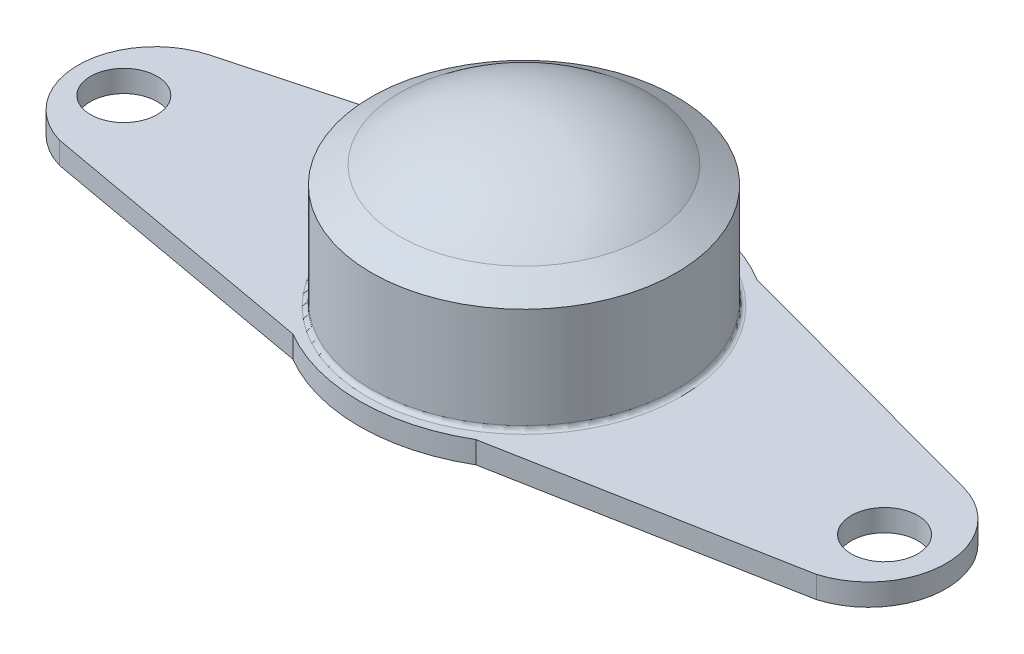
ISO-10303-21;
HEADER;
FILE_DESCRIPTION(('STEP AP214'),'2;1');
FILE_NAME('part.step','',(''),(''),'','','');
FILE_SCHEMA(('AUTOMOTIVE_DESIGN { 1 0 10303 214 1 1 1 1 }'));
ENDSEC;
DATA;
#1=APPLICATION_CONTEXT('core data for automotive mechanical design processes');
#2=APPLICATION_PROTOCOL_DEFINITION('international standard','automotive_design',2000,#1);
#3=PRODUCT_CONTEXT('',#1,'mechanical');
#4=PRODUCT('Part','Part','',(#3));
#5=PRODUCT_RELATED_PRODUCT_CATEGORY('part','',(#4));
#6=PRODUCT_DEFINITION_FORMATION('','',#4);
#7=PRODUCT_DEFINITION_CONTEXT('part definition',#1,'design');
#8=PRODUCT_DEFINITION('design','',#6,#7);
#9=PRODUCT_DEFINITION_SHAPE('','',#8);
#10=(LENGTH_UNIT() NAMED_UNIT(*) SI_UNIT(.MILLI.,.METRE.));
#11=(NAMED_UNIT(*) PLANE_ANGLE_UNIT() SI_UNIT($,.RADIAN.));
#12=(NAMED_UNIT(*) SI_UNIT($,.STERADIAN.) SOLID_ANGLE_UNIT());
#13=UNCERTAINTY_MEASURE_WITH_UNIT(LENGTH_MEASURE(1.E-05),#10,'distance_accuracy_value','');
#14=(GEOMETRIC_REPRESENTATION_CONTEXT(3) GLOBAL_UNCERTAINTY_ASSIGNED_CONTEXT((#13)) GLOBAL_UNIT_ASSIGNED_CONTEXT((#10,
#11,#12)) REPRESENTATION_CONTEXT('',''));
#15=CARTESIAN_POINT('',(0.,0.,0.));
#16=DIRECTION('',(0.,0.,1.));
#17=DIRECTION('',(1.,0.,0.));
#18=AXIS2_PLACEMENT_3D('',#15,#16,#17);
#19=CARTESIAN_POINT('',(0.,2.5,0.));
#20=DIRECTION('',(0.,1.,0.));
#21=DIRECTION('',(0.,0.,1.));
#22=AXIS2_PLACEMENT_3D('',#19,#20,#21);
#23=PLANE('',#22);
#24=CARTESIAN_POINT('',(-24.8478927236643,2.5,-20.4953921694321));
#25=DIRECTION('',(0.,1.,0.));
#26=DIRECTION('',(0.,0.,1.));
#27=AXIS2_PLACEMENT_3D('',#24,#25,#26);
#28=CIRCLE('',#27,17.9036643696297);
#29=CARTESIAN_POINT('',(-24.8478927236643,2.5,-2.59172779980247));
#30=VERTEX_POINT('',#29);
#31=EDGE_CURVE('E11',#30,#30,#28,.F.);
#32=ORIENTED_EDGE('',*,*,#31,.T.);
#33=EDGE_LOOP('',(#32));
#34=FACE_BOUND('',#33,.T.);
#35=CARTESIAN_POINT('',(-68.5099872093815,2.5,-18.4932623141663));
#36=DIRECTION('',(0.,1.,0.));
#37=DIRECTION('',(0.,0.,1.));
#38=AXIS2_PLACEMENT_3D('',#35,#36,#37);
#39=CIRCLE('',#38,3.79415254999999);
#40=CARTESIAN_POINT('',(-68.5099872093815,2.5,-14.6991097641663));
#41=VERTEX_POINT('',#40);
#42=EDGE_CURVE('E176',#41,#41,#39,.T.);
#43=ORIENTED_EDGE('',*,*,#42,.F.);
#44=EDGE_LOOP('',(#43));
#45=FACE_BOUND('',#44,.T.);
#46=CARTESIAN_POINT('',(18.3034860592528,2.5,-18.4932623141663));
#47=DIRECTION('',(0.,1.,0.));
#48=DIRECTION('',(0.,0.,1.));
#49=AXIS2_PLACEMENT_3D('',#46,#47,#48);
#50=CIRCLE('',#49,3.794155);
#51=CARTESIAN_POINT('',(18.3034860592528,2.5,-14.6991073141663));
#52=VERTEX_POINT('',#51);
#53=EDGE_CURVE('E173',#52,#52,#50,.T.);
#54=ORIENTED_EDGE('',*,*,#53,.F.);
#55=EDGE_LOOP('',(#54));
#56=FACE_BOUND('',#55,.T.);
#57=CARTESIAN_POINT('',(15.843912174543,2.5,-19.1437846710106));
#58=DIRECTION('',(0.,1.,0.));
#59=DIRECTION('',(0.,0.,1.));
#60=AXIS2_PLACEMENT_3D('',#57,#58,#59);
#61=CIRCLE('',#60,8.82234968708631);
#62=CARTESIAN_POINT('',(18.151883804096,2.5,-27.6588960007826));
#63=VERTEX_POINT('',#62);
#64=CARTESIAN_POINT('',(18.3297612293955,2.5,-10.6788919677497));
#65=VERTEX_POINT('',#64);
#66=EDGE_CURVE('E153',#63,#65,#61,.F.);
#67=ORIENTED_EDGE('',*,*,#66,.F.);
#68=DIRECTION('',(-0.965174996660574,0.,-0.261605095174504));
#69=VECTOR('',#68,1.);
#70=CARTESIAN_POINT('',(8.22598913222194,2.5,-30.3492522877896));
#71=LINE('',#70,#69);
#72=CARTESIAN_POINT('',(-14.156087825457,2.5,-36.4157846710106));
#73=VERTEX_POINT('',#72);
#74=EDGE_CURVE('E349',#63,#73,#71,.T.);
#75=ORIENTED_EDGE('',*,*,#74,.T.);
#76=CARTESIAN_POINT('',(-24.5138209557231,2.5,-19.5458172779228));
#77=DIRECTION('',(0.,1.,0.));
#78=DIRECTION('',(0.,0.,1.));
#79=AXIS2_PLACEMENT_3D('',#76,#77,#78);
#80=CIRCLE('',#79,19.7959196664782);
#81=CARTESIAN_POINT('',(-35.2979908669666,2.5,-36.1464231333454));
#82=VERTEX_POINT('',#81);
#83=EDGE_CURVE('E346',#73,#82,#80,.T.);
#84=ORIENTED_EDGE('',*,*,#83,.T.);
#85=DIRECTION('',(0.965174996660574,0.,-0.261605095174504));
#86=VECTOR('',#85,1.);
#87=CARTESIAN_POINT('',(-11.5424767236788,2.5,-42.5852177145104));
#88=LINE('',#87,#86);
#89=CARTESIAN_POINT('',(-67.6059624965196,2.5,-27.3895344631173));
#90=VERTEX_POINT('',#89);
#91=EDGE_CURVE('E348',#90,#82,#88,.T.);
#92=ORIENTED_EDGE('',*,*,#91,.F.);
#93=CARTESIAN_POINT('',(-65.2979908669666,2.5,-18.8744231333454));
#94=DIRECTION('',(0.,1.,0.));
#95=DIRECTION('',(0.,0.,1.));
#96=AXIS2_PLACEMENT_3D('',#93,#94,#95);
#97=CIRCLE('',#96,8.82234968708631);
#98=CARTESIAN_POINT('',(-67.7838399218191,2.5,-10.4095304300844));
#99=VERTEX_POINT('',#98);
#100=EDGE_CURVE('E114',#90,#99,#97,.T.);
#101=ORIENTED_EDGE('',*,*,#100,.T.);
#102=DIRECTION('',(0.984213782770149,0.,0.176983699264296));
#103=VECTOR('',#102,1.);
#104=CARTESIAN_POINT('',(-0.309974811409245,2.5,1.72378294141636));
#105=LINE('',#104,#103);
#106=CARTESIAN_POINT('',(-35.2979908669666,2.5,-4.56784660069628));
#107=VERTEX_POINT('',#106);
#108=EDGE_CURVE('E106',#99,#107,#105,.T.);
#109=ORIENTED_EDGE('',*,*,#108,.T.);
#110=CARTESIAN_POINT('',(-24.8604604325734,2.5,-22.3280311541789));
#111=DIRECTION('',(0.,1.,0.));
#112=DIRECTION('',(0.,0.,1.));
#113=AXIS2_PLACEMENT_3D('',#110,#111,#112);
#114=CIRCLE('',#113,20.6001504106802);
#115=CARTESIAN_POINT('',(-14.4229299981802,2.5,-4.56784660069629));
#116=VERTEX_POINT('',#115);
#117=EDGE_CURVE('E111',#116,#107,#114,.F.);
#118=ORIENTED_EDGE('',*,*,#117,.F.);
#119=DIRECTION('',(-0.983035352120809,0.,0.183416183802622));
#120=VECTOR('',#119,1.);
#121=CARTESIAN_POINT('',(-1.30881267021958,2.5,-7.0146979260785));
#122=LINE('',#121,#120);
#123=EDGE_CURVE('E129',#65,#116,#122,.T.);
#124=ORIENTED_EDGE('',*,*,#123,.F.);
#125=EDGE_LOOP('',(#67,#75,#84,#92,#101,#109,#118,#124));
#126=FACE_BOUND('',#125,.T.);
#127=ADVANCED_FACE('F37',(#34,#45,#56,#126),#23,.T.);
#128=CARTESIAN_POINT('',(15.843912174543,2.5,-19.1437846710106));
#129=DIRECTION('',(0.,-1.,0.));
#130=DIRECTION('',(0.,0.,-1.));
#131=AXIS2_PLACEMENT_3D('',#128,#129,#130);
#132=CYLINDRICAL_SURFACE('',#131,8.82234968708631);
#133=CARTESIAN_POINT('',(15.843912174543,0.,-19.1437846710106));
#134=DIRECTION('',(0.,1.,0.));
#135=DIRECTION('',(0.,0.,1.));
#136=AXIS2_PLACEMENT_3D('',#133,#134,#135);
#137=CIRCLE('',#136,8.82234968708631);
#138=CARTESIAN_POINT('',(18.151883804096,0.,-27.6588960007826));
#139=VERTEX_POINT('',#138);
#140=CARTESIAN_POINT('',(18.3297612293955,0.,-10.6788919677497));
#141=VERTEX_POINT('',#140);
#142=EDGE_CURVE('E134',#139,#141,#137,.F.);
#143=ORIENTED_EDGE('',*,*,#142,.F.);
#144=DIRECTION('',(0.,-1.,0.));
#145=VECTOR('',#144,1.);
#146=CARTESIAN_POINT('',(18.151883804096,2.5,-27.6588960007826));
#147=LINE('',#146,#145);
#148=EDGE_CURVE('E89',#63,#139,#147,.T.);
#149=ORIENTED_EDGE('',*,*,#148,.F.);
#150=ORIENTED_EDGE('',*,*,#66,.T.);
#151=DIRECTION('',(0.,-1.,0.));
#152=VECTOR('',#151,1.);
#153=CARTESIAN_POINT('',(18.3297612293955,2.5,-10.6788919677497));
#154=LINE('',#153,#152);
#155=EDGE_CURVE('E54',#65,#141,#154,.T.);
#156=ORIENTED_EDGE('',*,*,#155,.T.);
#157=EDGE_LOOP('',(#143,#149,#150,#156));
#158=FACE_BOUND('',#157,.T.);
#159=ADVANCED_FACE('F194',(#158),#132,.T.);
#160=CARTESIAN_POINT('',(8.22598913222194,2.5,-30.3492522877896));
#161=DIRECTION('',(-0.261605095174504,0.,0.965174996660574));
#162=DIRECTION('',(0.965174996660574,0.,0.261605095174504));
#163=AXIS2_PLACEMENT_3D('',#160,#161,#162);
#164=PLANE('',#163);
#165=DIRECTION('',(-0.965174996660574,0.,-0.261605095174504));
#166=VECTOR('',#165,1.);
#167=CARTESIAN_POINT('',(8.22598913222194,0.,-30.3492522877896));
#168=LINE('',#167,#166);
#169=CARTESIAN_POINT('',(-14.156087825457,0.,-36.4157846710106));
#170=VERTEX_POINT('',#169);
#171=EDGE_CURVE('E136',#139,#170,#168,.T.);
#172=ORIENTED_EDGE('',*,*,#171,.T.);
#173=DIRECTION('',(0.,-1.,0.));
#174=VECTOR('',#173,1.);
#175=CARTESIAN_POINT('',(-14.156087825457,2.5,-36.4157846710106));
#176=LINE('',#175,#174);
#177=EDGE_CURVE('E161',#73,#170,#176,.T.);
#178=ORIENTED_EDGE('',*,*,#177,.F.);
#179=ORIENTED_EDGE('',*,*,#74,.F.);
#180=ORIENTED_EDGE('',*,*,#148,.T.);
#181=EDGE_LOOP('',(#172,#178,#179,#180));
#182=FACE_BOUND('',#181,.T.);
#183=ADVANCED_FACE('F200',(#182),#164,.F.);
#184=CARTESIAN_POINT('',(-24.5138209557231,2.5,-19.5458172779228));
#185=DIRECTION('',(0.,-1.,0.));
#186=DIRECTION('',(0.,0.,-1.));
#187=AXIS2_PLACEMENT_3D('',#184,#185,#186);
#188=CYLINDRICAL_SURFACE('',#187,19.7959196664782);
#189=CARTESIAN_POINT('',(-24.5138209557231,0.,-19.5458172779228));
#190=DIRECTION('',(0.,1.,0.));
#191=DIRECTION('',(0.,0.,1.));
#192=AXIS2_PLACEMENT_3D('',#189,#190,#191);
#193=CIRCLE('',#192,19.7959196664782);
#194=CARTESIAN_POINT('',(-35.2979908669666,0.,-36.1464231333454));
#195=VERTEX_POINT('',#194);
#196=EDGE_CURVE('E139',#170,#195,#193,.T.);
#197=ORIENTED_EDGE('',*,*,#196,.T.);
#198=DIRECTION('',(0.,-1.,0.));
#199=VECTOR('',#198,1.);
#200=CARTESIAN_POINT('',(-35.2979908669666,2.5,-36.1464231333454));
#201=LINE('',#200,#199);
#202=EDGE_CURVE('E159',#82,#195,#201,.T.);
#203=ORIENTED_EDGE('',*,*,#202,.F.);
#204=ORIENTED_EDGE('',*,*,#83,.F.);
#205=ORIENTED_EDGE('',*,*,#177,.T.);
#206=EDGE_LOOP('',(#197,#203,#204,#205));
#207=FACE_BOUND('',#206,.T.);
#208=ADVANCED_FACE('F224',(#207),#188,.T.);
#209=CARTESIAN_POINT('',(-11.5424767236788,2.5,-42.5852177145104));
#210=DIRECTION('',(-0.261605095174504,0.,-0.965174996660574));
#211=DIRECTION('',(-0.965174996660574,0.,0.261605095174504));
#212=AXIS2_PLACEMENT_3D('',#209,#210,#211);
#213=PLANE('',#212);
#214=DIRECTION('',(0.965174996660574,0.,-0.261605095174504));
#215=VECTOR('',#214,1.);
#216=CARTESIAN_POINT('',(-11.5424767236788,0.,-42.5852177145104));
#217=LINE('',#216,#215);
#218=CARTESIAN_POINT('',(-67.6059624965196,0.,-27.3895344631173));
#219=VERTEX_POINT('',#218);
#220=EDGE_CURVE('E142',#219,#195,#217,.T.);
#221=ORIENTED_EDGE('',*,*,#220,.F.);
#222=DIRECTION('',(0.,-1.,0.));
#223=VECTOR('',#222,1.);
#224=CARTESIAN_POINT('',(-67.6059624965196,2.5,-27.3895344631173));
#225=LINE('',#224,#223);
#226=EDGE_CURVE('E157',#90,#219,#225,.T.);
#227=ORIENTED_EDGE('',*,*,#226,.F.);
#228=ORIENTED_EDGE('',*,*,#91,.T.);
#229=ORIENTED_EDGE('',*,*,#202,.T.);
#230=EDGE_LOOP('',(#221,#227,#228,#229));
#231=FACE_BOUND('',#230,.T.);
#232=ADVANCED_FACE('F220',(#231),#213,.T.);
#233=CARTESIAN_POINT('',(-65.2979908669666,2.5,-18.8744231333454));
#234=DIRECTION('',(0.,-1.,0.));
#235=DIRECTION('',(0.,0.,-1.));
#236=AXIS2_PLACEMENT_3D('',#233,#234,#235);
#237=CYLINDRICAL_SURFACE('',#236,8.82234968708631);
#238=CARTESIAN_POINT('',(-65.2979908669666,0.,-18.8744231333454));
#239=DIRECTION('',(0.,1.,0.));
#240=DIRECTION('',(0.,0.,1.));
#241=AXIS2_PLACEMENT_3D('',#238,#239,#240);
#242=CIRCLE('',#241,8.82234968708631);
#243=CARTESIAN_POINT('',(-67.7838399218191,0.,-10.4095304300844));
#244=VERTEX_POINT('',#243);
#245=EDGE_CURVE('E145',#219,#244,#242,.T.);
#246=ORIENTED_EDGE('',*,*,#245,.T.);
#247=DIRECTION('',(0.,-1.,0.));
#248=VECTOR('',#247,1.);
#249=CARTESIAN_POINT('',(-67.7838399218191,2.5,-10.4095304300844));
#250=LINE('',#249,#248);
#251=EDGE_CURVE('E126',#99,#244,#250,.T.);
#252=ORIENTED_EDGE('',*,*,#251,.F.);
#253=ORIENTED_EDGE('',*,*,#100,.F.);
#254=ORIENTED_EDGE('',*,*,#226,.T.);
#255=EDGE_LOOP('',(#246,#252,#253,#254));
#256=FACE_BOUND('',#255,.T.);
#257=ADVANCED_FACE('F217',(#256),#237,.T.);
#258=CARTESIAN_POINT('',(-0.309974811409245,2.5,1.72378294141636));
#259=DIRECTION('',(0.176983699264296,0.,-0.984213782770149));
#260=DIRECTION('',(-0.984213782770149,0.,-0.176983699264296));
#261=AXIS2_PLACEMENT_3D('',#258,#259,#260);
#262=PLANE('',#261);
#263=DIRECTION('',(0.984213782770149,0.,0.176983699264296));
#264=VECTOR('',#263,1.);
#265=CARTESIAN_POINT('',(-0.309974811409245,0.,1.72378294141636));
#266=LINE('',#265,#264);
#267=CARTESIAN_POINT('',(-35.2979908669666,0.,-4.56784660069628));
#268=VERTEX_POINT('',#267);
#269=EDGE_CURVE('E123',#244,#268,#266,.T.);
#270=ORIENTED_EDGE('',*,*,#269,.T.);
#271=DIRECTION('',(0.,-1.,0.));
#272=VECTOR('',#271,1.);
#273=CARTESIAN_POINT('',(-35.2979908669666,2.5,-4.56784660069628));
#274=LINE('',#273,#272);
#275=EDGE_CURVE('E120',#107,#268,#274,.T.);
#276=ORIENTED_EDGE('',*,*,#275,.F.);
#277=ORIENTED_EDGE('',*,*,#108,.F.);
#278=ORIENTED_EDGE('',*,*,#251,.T.);
#279=EDGE_LOOP('',(#270,#276,#277,#278));
#280=FACE_BOUND('',#279,.T.);
#281=ADVANCED_FACE('F121',(#280),#262,.F.);
#282=CARTESIAN_POINT('',(-24.8604604325734,2.5,-22.3280311541789));
#283=DIRECTION('',(0.,-1.,0.));
#284=DIRECTION('',(0.,0.,-1.));
#285=AXIS2_PLACEMENT_3D('',#282,#283,#284);
#286=CYLINDRICAL_SURFACE('',#285,20.6001504106802);
#287=CARTESIAN_POINT('',(-24.8604604325734,0.,-22.3280311541789));
#288=DIRECTION('',(0.,1.,0.));
#289=DIRECTION('',(0.,0.,1.));
#290=AXIS2_PLACEMENT_3D('',#287,#288,#289);
#291=CIRCLE('',#290,20.6001504106802);
#292=CARTESIAN_POINT('',(-14.4229299981802,0.,-4.56784660069629));
#293=VERTEX_POINT('',#292);
#294=EDGE_CURVE('E148',#293,#268,#291,.F.);
#295=ORIENTED_EDGE('',*,*,#294,.F.);
#296=DIRECTION('',(0.,-1.,0.));
#297=VECTOR('',#296,1.);
#298=CARTESIAN_POINT('',(-14.4229299981802,2.5,-4.56784660069629));
#299=LINE('',#298,#297);
#300=EDGE_CURVE('E80',#116,#293,#299,.T.);
#301=ORIENTED_EDGE('',*,*,#300,.F.);
#302=ORIENTED_EDGE('',*,*,#117,.T.);
#303=ORIENTED_EDGE('',*,*,#275,.T.);
#304=EDGE_LOOP('',(#295,#301,#302,#303));
#305=FACE_BOUND('',#304,.T.);
#306=ADVANCED_FACE('F128',(#305),#286,.T.);
#307=CARTESIAN_POINT('',(-1.30881267021958,2.5,-7.0146979260785));
#308=DIRECTION('',(0.183416183802622,0.,0.983035352120809));
#309=DIRECTION('',(0.983035352120809,0.,-0.183416183802622));
#310=AXIS2_PLACEMENT_3D('',#307,#308,#309);
#311=PLANE('',#310);
#312=DIRECTION('',(-0.983035352120809,0.,0.183416183802622));
#313=VECTOR('',#312,1.);
#314=CARTESIAN_POINT('',(-1.30881267021958,0.,-7.0146979260785));
#315=LINE('',#314,#313);
#316=EDGE_CURVE('E150',#141,#293,#315,.T.);
#317=ORIENTED_EDGE('',*,*,#316,.F.);
#318=ORIENTED_EDGE('',*,*,#155,.F.);
#319=ORIENTED_EDGE('',*,*,#123,.T.);
#320=ORIENTED_EDGE('',*,*,#300,.T.);
#321=EDGE_LOOP('',(#317,#318,#319,#320));
#322=FACE_BOUND('',#321,.T.);
#323=ADVANCED_FACE('F209',(#322),#311,.T.);
#324=CARTESIAN_POINT('',(0.,0.,0.));
#325=DIRECTION('',(0.,1.,0.));
#326=DIRECTION('',(0.,0.,1.));
#327=AXIS2_PLACEMENT_3D('',#324,#325,#326);
#328=PLANE('',#327);
#329=CARTESIAN_POINT('',(-68.5099872093815,0.,-18.4932623141663));
#330=DIRECTION('',(0.,1.,0.));
#331=DIRECTION('',(0.,0.,1.));
#332=AXIS2_PLACEMENT_3D('',#329,#330,#331);
#333=CIRCLE('',#332,3.79415254999999);
#334=CARTESIAN_POINT('',(-68.5099872093815,0.,-14.6991097641663));
#335=VERTEX_POINT('',#334);
#336=EDGE_CURVE('E174',#335,#335,#333,.T.);
#337=ORIENTED_EDGE('',*,*,#336,.T.);
#338=EDGE_LOOP('',(#337));
#339=FACE_BOUND('',#338,.T.);
#340=CARTESIAN_POINT('',(18.3034860592528,0.,-18.4932623141663));
#341=DIRECTION('',(0.,1.,0.));
#342=DIRECTION('',(0.,0.,1.));
#343=AXIS2_PLACEMENT_3D('',#340,#341,#342);
#344=CIRCLE('',#343,3.794155);
#345=CARTESIAN_POINT('',(18.3034860592528,0.,-14.6991073141663));
#346=VERTEX_POINT('',#345);
#347=EDGE_CURVE('E137',#346,#346,#344,.T.);
#348=ORIENTED_EDGE('',*,*,#347,.T.);
#349=EDGE_LOOP('',(#348));
#350=FACE_BOUND('',#349,.T.);
#351=ORIENTED_EDGE('',*,*,#142,.T.);
#352=ORIENTED_EDGE('',*,*,#316,.T.);
#353=ORIENTED_EDGE('',*,*,#294,.T.);
#354=ORIENTED_EDGE('',*,*,#269,.F.);
#355=ORIENTED_EDGE('',*,*,#245,.F.);
#356=ORIENTED_EDGE('',*,*,#220,.T.);
#357=ORIENTED_EDGE('',*,*,#196,.F.);
#358=ORIENTED_EDGE('',*,*,#171,.F.);
#359=EDGE_LOOP('',(#351,#352,#353,#354,#355,#356,#357,#358));
#360=FACE_BOUND('',#359,.T.);
#361=ADVANCED_FACE('F206',(#339,#350,#360),#328,.F.);
#362=CARTESIAN_POINT('',(-24.8478927236643,16.5,-20.4953921694321));
#363=DIRECTION('',(0.,-1.,0.));
#364=DIRECTION('',(0.,0.,-1.));
#365=AXIS2_PLACEMENT_3D('',#362,#363,#364);
#366=CYLINDRICAL_SURFACE('',#365,17.4036643696297);
#367=CARTESIAN_POINT('',(-24.8478927236643,3.,-20.4953921694321));
#368=DIRECTION('',(0.,1.,0.));
#369=DIRECTION('',(0.,0.,1.));
#370=AXIS2_PLACEMENT_3D('',#367,#368,#369);
#371=CIRCLE('',#370,17.4036643696297);
#372=CARTESIAN_POINT('',(-24.8478927236643,3.,-3.09172779980247));
#373=VERTEX_POINT('',#372);
#374=EDGE_CURVE('E46',#373,#373,#371,.T.);
#375=ORIENTED_EDGE('',*,*,#374,.T.);
#376=EDGE_LOOP('',(#375));
#377=FACE_BOUND('',#376,.T.);
#378=CARTESIAN_POINT('',(-24.8478927236643,14.5,-20.4953921694321));
#379=DIRECTION('',(0.,1.,0.));
#380=DIRECTION('',(0.,0.,1.));
#381=AXIS2_PLACEMENT_3D('',#378,#379,#380);
#382=CIRCLE('',#381,17.4036643696297);
#383=CARTESIAN_POINT('',(-24.8478927236643,14.5,-3.09172779980247));
#384=VERTEX_POINT('',#383);
#385=EDGE_CURVE('E166',#384,#384,#382,.F.);
#386=ORIENTED_EDGE('',*,*,#385,.T.);
#387=EDGE_LOOP('',(#386));
#388=FACE_BOUND('',#387,.T.);
#389=ADVANCED_FACE('F180',(#377,#388),#366,.T.);
#390=CARTESIAN_POINT('',(-24.8478927236643,-0.814830297228807,-20.4953921694321));
#391=DIRECTION('',(0.,0.,1.));
#392=DIRECTION('',(1.,0.,0.));
#393=AXIS2_PLACEMENT_3D('',#390,#391,#392);
#394=SPHERICAL_SURFACE('',#393,22.3948302972288);
#395=CARTESIAN_POINT('',(-24.8478927236643,-0.814830297228807,-20.4953921694321));
#396=DIRECTION('',(0.,1.,0.));
#397=DIRECTION('',(0.,0.,1.));
#398=AXIS2_PLACEMENT_3D('',#395,#396,#397);
#399=SPHERICAL_SURFACE('',#398,22.3948302972288);
#400=CARTESIAN_POINT('',(-24.8478927236643,16.5,-20.4953921694321));
#401=DIRECTION('',(0.,1.,0.));
#402=DIRECTION('',(0.,0.,1.));
#403=AXIS2_PLACEMENT_3D('',#400,#401,#402);
#404=CIRCLE('',#403,14.2029953115477);
#405=CARTESIAN_POINT('',(-24.8478927236643,16.5,-6.29239685788449));
#406=VERTEX_POINT('',#405);
#407=EDGE_CURVE('E165',#406,#406,#404,.T.);
#408=ORIENTED_EDGE('',*,*,#407,.T.);
#409=EDGE_LOOP('',(#408));
#410=FACE_BOUND('',#409,.T.);
#411=ADVANCED_FACE('F234',(#410),#399,.T.);
#412=CARTESIAN_POINT('',(-24.8478927236643,16.5,-20.4953921694321));
#413=DIRECTION('',(0.,-1.,0.));
#414=DIRECTION('',(0.,0.,-1.));
#415=AXIS2_PLACEMENT_3D('',#412,#413,#414);
#416=CONICAL_SURFACE('',#415,14.2029953115477,1.01229096615671);
#417=ORIENTED_EDGE('',*,*,#385,.F.);
#418=EDGE_LOOP('',(#417));
#419=FACE_BOUND('',#418,.T.);
#420=ORIENTED_EDGE('',*,*,#407,.F.);
#421=EDGE_LOOP('',(#420));
#422=FACE_BOUND('',#421,.T.);
#423=ADVANCED_FACE('F232',(#419,#422),#416,.T.);
#424=CARTESIAN_POINT('',(18.3034860592528,-19.725,-18.4932623141663));
#425=DIRECTION('',(0.,1.,0.));
#426=DIRECTION('',(0.,0.,1.));
#427=AXIS2_PLACEMENT_3D('',#424,#425,#426);
#428=CYLINDRICAL_SURFACE('',#427,3.794155);
#429=ORIENTED_EDGE('',*,*,#53,.T.);
#430=EDGE_LOOP('',(#429));
#431=FACE_BOUND('',#430,.T.);
#432=ORIENTED_EDGE('',*,*,#347,.F.);
#433=EDGE_LOOP('',(#432));
#434=FACE_BOUND('',#433,.T.);
#435=ADVANCED_FACE('F189',(#431,#434),#428,.F.);
#436=CARTESIAN_POINT('',(-68.5099872093815,-19.725,-18.4932623141663));
#437=DIRECTION('',(0.,1.,0.));
#438=DIRECTION('',(0.,0.,1.));
#439=AXIS2_PLACEMENT_3D('',#436,#437,#438);
#440=CYLINDRICAL_SURFACE('',#439,3.79415254999999);
#441=ORIENTED_EDGE('',*,*,#42,.T.);
#442=EDGE_LOOP('',(#441));
#443=FACE_BOUND('',#442,.T.);
#444=ORIENTED_EDGE('',*,*,#336,.F.);
#445=EDGE_LOOP('',(#444));
#446=FACE_BOUND('',#445,.T.);
#447=ADVANCED_FACE('F184',(#443,#446),#440,.F.);
#448=CARTESIAN_POINT('',(-24.8478927236643,3.,-20.4953921694321));
#449=DIRECTION('',(0.,1.,0.));
#450=DIRECTION('',(0.,0.,1.));
#451=AXIS2_PLACEMENT_3D('',#448,#449,#450);
#452=TOROIDAL_SURFACE('',#451,17.9036643696297,0.5);
#453=ORIENTED_EDGE('',*,*,#31,.F.);
#454=EDGE_LOOP('',(#453));
#455=FACE_BOUND('',#454,.T.);
#456=ORIENTED_EDGE('',*,*,#374,.F.);
#457=EDGE_LOOP('',(#456));
#458=FACE_BOUND('',#457,.T.);
#459=ADVANCED_FACE('F39',(#455,#458),#452,.F.);
#460=CLOSED_SHELL('',(#127,#159,#183,#208,#232,#257,#281,#306,#323,#361,#389,#411,#423,#435,
#447,#459));
#461=MANIFOLD_SOLID_BREP('B2',#460);
#462=ADVANCED_BREP_SHAPE_REPRESENTATION('',(#18,#461),#14);
#463=SHAPE_DEFINITION_REPRESENTATION(#9,#462);
ENDSEC;
END-ISO-10303-21;
